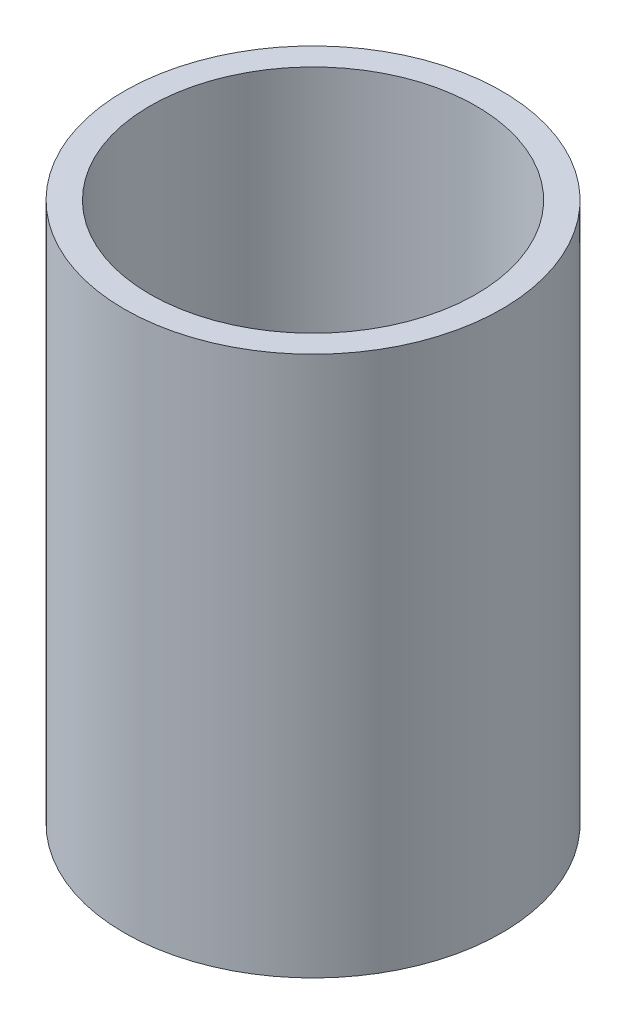
ISO-10303-21;
HEADER;
FILE_DESCRIPTION(('STEP AP214'),'2;1');
FILE_NAME('part.step','',(''),(''),'','','');
FILE_SCHEMA(('AUTOMOTIVE_DESIGN { 1 0 10303 214 1 1 1 1 }'));
ENDSEC;
DATA;
#1=APPLICATION_CONTEXT('core data for automotive mechanical design processes');
#2=APPLICATION_PROTOCOL_DEFINITION('international standard','automotive_design',2000,#1);
#3=PRODUCT_CONTEXT('',#1,'mechanical');
#4=PRODUCT('Part','Part','',(#3));
#5=PRODUCT_RELATED_PRODUCT_CATEGORY('part','',(#4));
#6=PRODUCT_DEFINITION_FORMATION('','',#4);
#7=PRODUCT_DEFINITION_CONTEXT('part definition',#1,'design');
#8=PRODUCT_DEFINITION('design','',#6,#7);
#9=PRODUCT_DEFINITION_SHAPE('','',#8);
#10=(LENGTH_UNIT() NAMED_UNIT(*) SI_UNIT(.MILLI.,.METRE.));
#11=(NAMED_UNIT(*) PLANE_ANGLE_UNIT() SI_UNIT($,.RADIAN.));
#12=(NAMED_UNIT(*) SI_UNIT($,.STERADIAN.) SOLID_ANGLE_UNIT());
#13=UNCERTAINTY_MEASURE_WITH_UNIT(LENGTH_MEASURE(1.E-05),#10,'distance_accuracy_value','');
#14=(GEOMETRIC_REPRESENTATION_CONTEXT(3) GLOBAL_UNCERTAINTY_ASSIGNED_CONTEXT((#13)) GLOBAL_UNIT_ASSIGNED_CONTEXT((#10,
#11,#12)) REPRESENTATION_CONTEXT('',''));
#15=CARTESIAN_POINT('',(0.,0.,0.));
#16=DIRECTION('',(0.,0.,1.));
#17=DIRECTION('',(1.,0.,0.));
#18=AXIS2_PLACEMENT_3D('',#15,#16,#17);
#19=CARTESIAN_POINT('',(0.,55.,0.));
#20=DIRECTION('',(0.,1.,0.));
#21=DIRECTION('',(0.,0.,1.));
#22=AXIS2_PLACEMENT_3D('',#19,#20,#21);
#23=CYLINDRICAL_SURFACE('',#22,46.609);
#24=CARTESIAN_POINT('',(0.,-87.732365567385,0.));
#25=DIRECTION('',(0.,1.,0.));
#26=DIRECTION('',(0.,0.,1.));
#27=AXIS2_PLACEMENT_3D('',#24,#25,#26);
#28=CIRCLE('',#27,46.609);
#29=CARTESIAN_POINT('',(0.,-87.732365567385,46.609));
#30=VERTEX_POINT('',#29);
#31=EDGE_CURVE('E12',#30,#30,#28,.T.);
#32=ORIENTED_EDGE('',*,*,#31,.T.);
#33=EDGE_LOOP('',(#32));
#34=FACE_BOUND('',#33,.T.);
#35=CARTESIAN_POINT('',(0.,45.6176344326149,0.));
#36=DIRECTION('',(0.,1.,0.));
#37=DIRECTION('',(0.,0.,1.));
#38=AXIS2_PLACEMENT_3D('',#35,#36,#37);
#39=CIRCLE('',#38,46.609);
#40=CARTESIAN_POINT('',(0.,45.6176344326149,46.609));
#41=VERTEX_POINT('',#40);
#42=EDGE_CURVE('E55',#41,#41,#39,.T.);
#43=ORIENTED_EDGE('',*,*,#42,.F.);
#44=EDGE_LOOP('',(#43));
#45=FACE_BOUND('',#44,.T.);
#46=ADVANCED_FACE('F41',(#34,#45),#23,.T.);
#47=CARTESIAN_POINT('',(-46.609,-87.732365567385,0.));
#48=DIRECTION('',(0.,-1.,0.));
#49=DIRECTION('',(0.,0.,-1.));
#50=AXIS2_PLACEMENT_3D('',#47,#48,#49);
#51=PLANE('',#50);
#52=CARTESIAN_POINT('',(0.,-87.732365567385,0.));
#53=DIRECTION('',(0.,1.,0.));
#54=DIRECTION('',(0.,0.,1.));
#55=AXIS2_PLACEMENT_3D('',#52,#53,#54);
#56=CIRCLE('',#55,40.259);
#57=CARTESIAN_POINT('',(0.,-87.732365567385,40.259));
#58=VERTEX_POINT('',#57);
#59=EDGE_CURVE('E47',#58,#58,#56,.T.);
#60=ORIENTED_EDGE('',*,*,#59,.T.);
#61=EDGE_LOOP('',(#60));
#62=FACE_BOUND('',#61,.T.);
#63=ORIENTED_EDGE('',*,*,#31,.F.);
#64=EDGE_LOOP('',(#63));
#65=FACE_BOUND('',#64,.T.);
#66=ADVANCED_FACE('F65',(#62,#65),#51,.T.);
#67=CARTESIAN_POINT('',(0.,55.,0.));
#68=DIRECTION('',(0.,1.,0.));
#69=DIRECTION('',(0.,0.,1.));
#70=AXIS2_PLACEMENT_3D('',#67,#68,#69);
#71=CYLINDRICAL_SURFACE('',#70,40.259);
#72=CARTESIAN_POINT('',(0.,45.6176344326149,0.));
#73=DIRECTION('',(0.,1.,0.));
#74=DIRECTION('',(0.,0.,1.));
#75=AXIS2_PLACEMENT_3D('',#72,#73,#74);
#76=CIRCLE('',#75,40.259);
#77=CARTESIAN_POINT('',(0.,45.6176344326149,40.259));
#78=VERTEX_POINT('',#77);
#79=EDGE_CURVE('E51',#78,#78,#76,.T.);
#80=ORIENTED_EDGE('',*,*,#79,.T.);
#81=EDGE_LOOP('',(#80));
#82=FACE_BOUND('',#81,.T.);
#83=ORIENTED_EDGE('',*,*,#59,.F.);
#84=EDGE_LOOP('',(#83));
#85=FACE_BOUND('',#84,.T.);
#86=ADVANCED_FACE('F69',(#82,#85),#71,.F.);
#87=CARTESIAN_POINT('',(-46.609,45.6176344326149,0.));
#88=DIRECTION('',(0.,1.,0.));
#89=DIRECTION('',(0.,0.,1.));
#90=AXIS2_PLACEMENT_3D('',#87,#88,#89);
#91=PLANE('',#90);
#92=ORIENTED_EDGE('',*,*,#42,.T.);
#93=EDGE_LOOP('',(#92));
#94=FACE_BOUND('',#93,.T.);
#95=ORIENTED_EDGE('',*,*,#79,.F.);
#96=EDGE_LOOP('',(#95));
#97=FACE_BOUND('',#96,.T.);
#98=ADVANCED_FACE('F61',(#94,#97),#91,.T.);
#99=CLOSED_SHELL('',(#46,#66,#86,#98));
#100=MANIFOLD_SOLID_BREP('B2',#99);
#101=ADVANCED_BREP_SHAPE_REPRESENTATION('',(#18,#100),#14);
#102=SHAPE_DEFINITION_REPRESENTATION(#9,#101);
ENDSEC;
END-ISO-10303-21;
